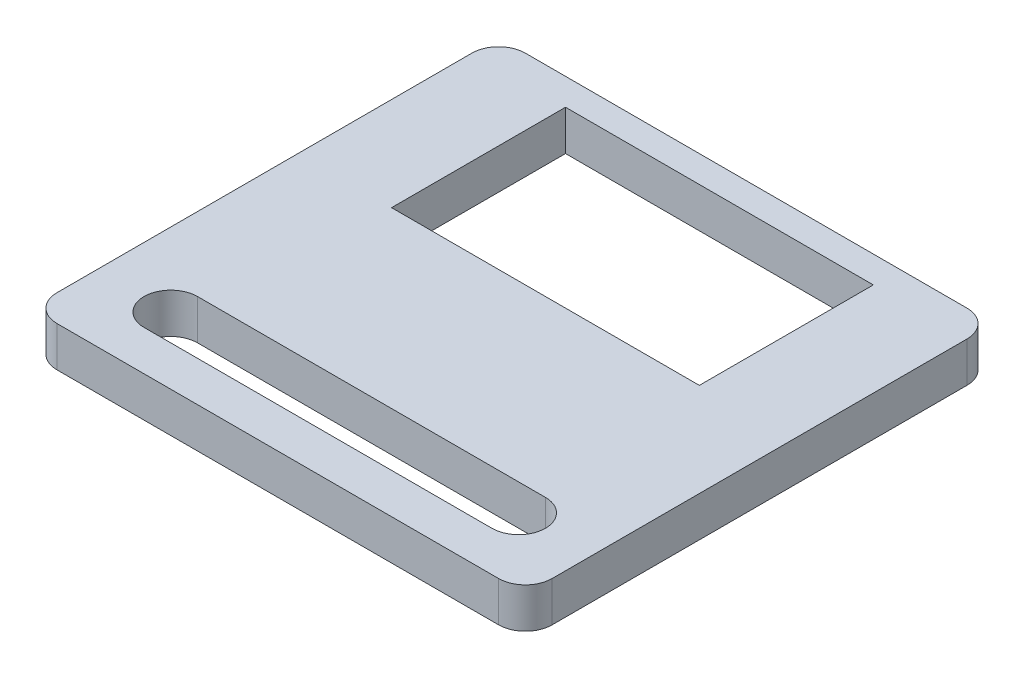
ISO-10303-21;
HEADER;
FILE_DESCRIPTION(('STEP AP214'),'2;1');
FILE_NAME('part.step','',(''),(''),'','','');
FILE_SCHEMA(('AUTOMOTIVE_DESIGN { 1 0 10303 214 1 1 1 1 }'));
ENDSEC;
DATA;
#1=APPLICATION_CONTEXT('core data for automotive mechanical design processes');
#2=APPLICATION_PROTOCOL_DEFINITION('international standard','automotive_design',2000,#1);
#3=PRODUCT_CONTEXT('',#1,'mechanical');
#4=PRODUCT('Part','Part','',(#3));
#5=PRODUCT_RELATED_PRODUCT_CATEGORY('part','',(#4));
#6=PRODUCT_DEFINITION_FORMATION('','',#4);
#7=PRODUCT_DEFINITION_CONTEXT('part definition',#1,'design');
#8=PRODUCT_DEFINITION('design','',#6,#7);
#9=PRODUCT_DEFINITION_SHAPE('','',#8);
#10=(LENGTH_UNIT() NAMED_UNIT(*) SI_UNIT(.MILLI.,.METRE.));
#11=(NAMED_UNIT(*) PLANE_ANGLE_UNIT() SI_UNIT($,.RADIAN.));
#12=(NAMED_UNIT(*) SI_UNIT($,.STERADIAN.) SOLID_ANGLE_UNIT());
#13=UNCERTAINTY_MEASURE_WITH_UNIT(LENGTH_MEASURE(1.E-05),#10,'distance_accuracy_value','');
#14=(GEOMETRIC_REPRESENTATION_CONTEXT(3) GLOBAL_UNCERTAINTY_ASSIGNED_CONTEXT((#13)) GLOBAL_UNIT_ASSIGNED_CONTEXT((#10,
#11,#12)) REPRESENTATION_CONTEXT('',''));
#15=CARTESIAN_POINT('',(0.,0.,0.));
#16=DIRECTION('',(0.,0.,1.));
#17=DIRECTION('',(1.,0.,0.));
#18=AXIS2_PLACEMENT_3D('',#15,#16,#17);
#19=CARTESIAN_POINT('',(0.,3.,0.));
#20=DIRECTION('',(0.,-1.,0.));
#21=DIRECTION('',(0.,0.,-1.));
#22=AXIS2_PLACEMENT_3D('',#19,#20,#21);
#23=PLANE('',#22);
#24=DIRECTION('',(0.,0.,-1.));
#25=VECTOR('',#24,1.);
#26=CARTESIAN_POINT('',(11.5,3.,-15.5));
#27=LINE('',#26,#25);
#28=CARTESIAN_POINT('',(11.5,3.,-2.5));
#29=VERTEX_POINT('',#28);
#30=CARTESIAN_POINT('',(11.5,3.,-15.5));
#31=VERTEX_POINT('',#30);
#32=EDGE_CURVE('E212',#29,#31,#27,.T.);
#33=ORIENTED_EDGE('',*,*,#32,.F.);
#34=DIRECTION('',(1.,0.,0.));
#35=VECTOR('',#34,1.);
#36=CARTESIAN_POINT('',(-11.5,3.,-2.5));
#37=LINE('',#36,#35);
#38=CARTESIAN_POINT('',(-11.5,3.,-2.5));
#39=VERTEX_POINT('',#38);
#40=EDGE_CURVE('E223',#39,#29,#37,.T.);
#41=ORIENTED_EDGE('',*,*,#40,.F.);
#42=DIRECTION('',(0.,0.,1.));
#43=VECTOR('',#42,1.);
#44=CARTESIAN_POINT('',(-11.5,3.,-15.5));
#45=LINE('',#44,#43);
#46=CARTESIAN_POINT('',(-11.5,3.,-15.5));
#47=VERTEX_POINT('',#46);
#48=EDGE_CURVE('E219',#47,#39,#45,.T.);
#49=ORIENTED_EDGE('',*,*,#48,.F.);
#50=DIRECTION('',(-1.,0.,0.));
#51=VECTOR('',#50,1.);
#52=CARTESIAN_POINT('',(-11.5,3.,-15.5));
#53=LINE('',#52,#51);
#54=EDGE_CURVE('E215',#31,#47,#53,.T.);
#55=ORIENTED_EDGE('',*,*,#54,.F.);
#56=EDGE_LOOP('',(#33,#41,#49,#55));
#57=FACE_BOUND('',#56,.T.);
#58=DIRECTION('',(0.,0.,-1.));
#59=VECTOR('',#58,1.);
#60=CARTESIAN_POINT('',(18.5,3.,17.5));
#61=LINE('',#60,#59);
#62=CARTESIAN_POINT('',(18.5,3.,15.5));
#63=VERTEX_POINT('',#62);
#64=CARTESIAN_POINT('',(18.5,3.,-15.5));
#65=VERTEX_POINT('',#64);
#66=EDGE_CURVE('E255',#63,#65,#61,.T.);
#67=ORIENTED_EDGE('',*,*,#66,.T.);
#68=CARTESIAN_POINT('',(16.5,3.,-15.5));
#69=DIRECTION('',(0.,-1.,0.));
#70=DIRECTION('',(0.,0.,-1.));
#71=AXIS2_PLACEMENT_3D('',#68,#69,#70);
#72=CIRCLE('',#71,2.);
#73=CARTESIAN_POINT('',(16.5,3.,-17.5));
#74=VERTEX_POINT('',#73);
#75=EDGE_CURVE('E317',#65,#74,#72,.F.);
#76=ORIENTED_EDGE('',*,*,#75,.T.);
#77=DIRECTION('',(-1.,0.,0.));
#78=VECTOR('',#77,1.);
#79=CARTESIAN_POINT('',(-18.5,3.,-17.5));
#80=LINE('',#79,#78);
#81=CARTESIAN_POINT('',(-16.5,3.,-17.5));
#82=VERTEX_POINT('',#81);
#83=EDGE_CURVE('E259',#74,#82,#80,.T.);
#84=ORIENTED_EDGE('',*,*,#83,.T.);
#85=CARTESIAN_POINT('',(-16.5,3.,-15.5));
#86=DIRECTION('',(0.,-1.,0.));
#87=DIRECTION('',(0.,0.,-1.));
#88=AXIS2_PLACEMENT_3D('',#85,#86,#87);
#89=CIRCLE('',#88,2.);
#90=CARTESIAN_POINT('',(-18.5,3.,-15.5));
#91=VERTEX_POINT('',#90);
#92=EDGE_CURVE('E309',#82,#91,#89,.F.);
#93=ORIENTED_EDGE('',*,*,#92,.T.);
#94=DIRECTION('',(0.,0.,1.));
#95=VECTOR('',#94,1.);
#96=CARTESIAN_POINT('',(-18.5,3.,17.5));
#97=LINE('',#96,#95);
#98=CARTESIAN_POINT('',(-18.5,3.,15.5));
#99=VERTEX_POINT('',#98);
#100=EDGE_CURVE('E264',#91,#99,#97,.T.);
#101=ORIENTED_EDGE('',*,*,#100,.T.);
#102=CARTESIAN_POINT('',(-16.5,3.,15.5));
#103=DIRECTION('',(0.,-1.,0.));
#104=DIRECTION('',(0.,0.,-1.));
#105=AXIS2_PLACEMENT_3D('',#102,#103,#104);
#106=CIRCLE('',#105,2.);
#107=CARTESIAN_POINT('',(-16.5,3.,17.5));
#108=VERTEX_POINT('',#107);
#109=EDGE_CURVE('E66',#99,#108,#106,.F.);
#110=ORIENTED_EDGE('',*,*,#109,.T.);
#111=DIRECTION('',(1.,0.,0.));
#112=VECTOR('',#111,1.);
#113=CARTESIAN_POINT('',(-18.5,3.,17.5));
#114=LINE('',#113,#112);
#115=CARTESIAN_POINT('',(16.5,3.,17.5));
#116=VERTEX_POINT('',#115);
#117=EDGE_CURVE('E267',#108,#116,#114,.T.);
#118=ORIENTED_EDGE('',*,*,#117,.T.);
#119=CARTESIAN_POINT('',(16.5,3.,15.5));
#120=DIRECTION('',(0.,-1.,0.));
#121=DIRECTION('',(0.,0.,-1.));
#122=AXIS2_PLACEMENT_3D('',#119,#120,#121);
#123=CIRCLE('',#122,2.);
#124=EDGE_CURVE('E314',#116,#63,#123,.F.);
#125=ORIENTED_EDGE('',*,*,#124,.T.);
#126=EDGE_LOOP('',(#67,#76,#84,#93,#101,#110,#118,#125));
#127=FACE_BOUND('',#126,.T.);
#128=CARTESIAN_POINT('',(-13.,3.,12.5));
#129=DIRECTION('',(0.,1.,0.));
#130=DIRECTION('',(0.,0.,1.));
#131=AXIS2_PLACEMENT_3D('',#128,#129,#130);
#132=CIRCLE('',#131,2.);
#133=CARTESIAN_POINT('',(-13.,3.,10.5));
#134=VERTEX_POINT('',#133);
#135=CARTESIAN_POINT('',(-13.,3.,14.5));
#136=VERTEX_POINT('',#135);
#137=EDGE_CURVE('E159',#134,#136,#132,.T.);
#138=ORIENTED_EDGE('',*,*,#137,.F.);
#139=DIRECTION('',(-1.,0.,0.));
#140=VECTOR('',#139,1.);
#141=CARTESIAN_POINT('',(-13.,3.,10.5));
#142=LINE('',#141,#140);
#143=CARTESIAN_POINT('',(13.,3.,10.5));
#144=VERTEX_POINT('',#143);
#145=EDGE_CURVE('E188',#144,#134,#142,.T.);
#146=ORIENTED_EDGE('',*,*,#145,.F.);
#147=CARTESIAN_POINT('',(13.,3.,12.5));
#148=DIRECTION('',(0.,1.,0.));
#149=DIRECTION('',(0.,0.,-1.));
#150=AXIS2_PLACEMENT_3D('',#147,#148,#149);
#151=CIRCLE('',#150,2.);
#152=CARTESIAN_POINT('',(13.,3.,14.5));
#153=VERTEX_POINT('',#152);
#154=EDGE_CURVE('E184',#153,#144,#151,.T.);
#155=ORIENTED_EDGE('',*,*,#154,.F.);
#156=DIRECTION('',(1.,0.,0.));
#157=VECTOR('',#156,1.);
#158=CARTESIAN_POINT('',(-13.,3.,14.5));
#159=LINE('',#158,#157);
#160=EDGE_CURVE('E170',#136,#153,#159,.T.);
#161=ORIENTED_EDGE('',*,*,#160,.F.);
#162=EDGE_LOOP('',(#138,#146,#155,#161));
#163=FACE_BOUND('',#162,.T.);
#164=ADVANCED_FACE('F43',(#57,#127,#163),#23,.F.);
#165=CARTESIAN_POINT('',(0.,0.,0.));
#166=DIRECTION('',(0.,-1.,0.));
#167=DIRECTION('',(0.,0.,-1.));
#168=AXIS2_PLACEMENT_3D('',#165,#166,#167);
#169=PLANE('',#168);
#170=DIRECTION('',(-1.,0.,0.));
#171=VECTOR('',#170,1.);
#172=CARTESIAN_POINT('',(-18.5,0.,-17.5));
#173=LINE('',#172,#171);
#174=CARTESIAN_POINT('',(16.5,0.,-17.5));
#175=VERTEX_POINT('',#174);
#176=CARTESIAN_POINT('',(-16.5,0.,-17.5));
#177=VERTEX_POINT('',#176);
#178=EDGE_CURVE('E274',#175,#177,#173,.T.);
#179=ORIENTED_EDGE('',*,*,#178,.F.);
#180=CARTESIAN_POINT('',(16.5,0.,-15.5));
#181=DIRECTION('',(0.,-1.,0.));
#182=DIRECTION('',(0.,0.,-1.));
#183=AXIS2_PLACEMENT_3D('',#180,#181,#182);
#184=CIRCLE('',#183,2.);
#185=CARTESIAN_POINT('',(18.5,0.,-15.5));
#186=VERTEX_POINT('',#185);
#187=EDGE_CURVE('E299',#175,#186,#184,.T.);
#188=ORIENTED_EDGE('',*,*,#187,.T.);
#189=DIRECTION('',(0.,0.,-1.));
#190=VECTOR('',#189,1.);
#191=CARTESIAN_POINT('',(18.5,0.,17.5));
#192=LINE('',#191,#190);
#193=CARTESIAN_POINT('',(18.5,0.,15.5));
#194=VERTEX_POINT('',#193);
#195=EDGE_CURVE('E254',#194,#186,#192,.T.);
#196=ORIENTED_EDGE('',*,*,#195,.F.);
#197=CARTESIAN_POINT('',(16.5,0.,15.5));
#198=DIRECTION('',(0.,-1.,0.));
#199=DIRECTION('',(0.,0.,-1.));
#200=AXIS2_PLACEMENT_3D('',#197,#198,#199);
#201=CIRCLE('',#200,2.);
#202=CARTESIAN_POINT('',(16.5,0.,17.5));
#203=VERTEX_POINT('',#202);
#204=EDGE_CURVE('E296',#194,#203,#201,.T.);
#205=ORIENTED_EDGE('',*,*,#204,.T.);
#206=DIRECTION('',(1.,0.,0.));
#207=VECTOR('',#206,1.);
#208=CARTESIAN_POINT('',(-18.5,0.,17.5));
#209=LINE('',#208,#207);
#210=CARTESIAN_POINT('',(-16.5,0.,17.5));
#211=VERTEX_POINT('',#210);
#212=EDGE_CURVE('E260',#211,#203,#209,.T.);
#213=ORIENTED_EDGE('',*,*,#212,.F.);
#214=CARTESIAN_POINT('',(-16.5,0.,15.5));
#215=DIRECTION('',(0.,-1.,0.));
#216=DIRECTION('',(0.,0.,-1.));
#217=AXIS2_PLACEMENT_3D('',#214,#215,#216);
#218=CIRCLE('',#217,2.);
#219=CARTESIAN_POINT('',(-18.5,0.,15.5));
#220=VERTEX_POINT('',#219);
#221=EDGE_CURVE('E293',#211,#220,#218,.T.);
#222=ORIENTED_EDGE('',*,*,#221,.T.);
#223=DIRECTION('',(0.,0.,1.));
#224=VECTOR('',#223,1.);
#225=CARTESIAN_POINT('',(-18.5,0.,17.5));
#226=LINE('',#225,#224);
#227=CARTESIAN_POINT('',(-18.5,0.,-15.5));
#228=VERTEX_POINT('',#227);
#229=EDGE_CURVE('E278',#228,#220,#226,.T.);
#230=ORIENTED_EDGE('',*,*,#229,.F.);
#231=CARTESIAN_POINT('',(-16.5,0.,-15.5));
#232=DIRECTION('',(0.,-1.,0.));
#233=DIRECTION('',(0.,0.,-1.));
#234=AXIS2_PLACEMENT_3D('',#231,#232,#233);
#235=CIRCLE('',#234,2.);
#236=EDGE_CURVE('E290',#228,#177,#235,.T.);
#237=ORIENTED_EDGE('',*,*,#236,.T.);
#238=EDGE_LOOP('',(#179,#188,#196,#205,#213,#222,#230,#237));
#239=FACE_BOUND('',#238,.T.);
#240=DIRECTION('',(1.,0.,0.));
#241=VECTOR('',#240,1.);
#242=CARTESIAN_POINT('',(-11.5,0.,-2.5));
#243=LINE('',#242,#241);
#244=CARTESIAN_POINT('',(-11.5,0.,-2.5));
#245=VERTEX_POINT('',#244);
#246=CARTESIAN_POINT('',(11.5,0.,-2.5));
#247=VERTEX_POINT('',#246);
#248=EDGE_CURVE('E216',#245,#247,#243,.T.);
#249=ORIENTED_EDGE('',*,*,#248,.T.);
#250=DIRECTION('',(0.,0.,-1.));
#251=VECTOR('',#250,1.);
#252=CARTESIAN_POINT('',(11.5,0.,-15.5));
#253=LINE('',#252,#251);
#254=CARTESIAN_POINT('',(11.5,0.,-15.5));
#255=VERTEX_POINT('',#254);
#256=EDGE_CURVE('E179',#247,#255,#253,.T.);
#257=ORIENTED_EDGE('',*,*,#256,.T.);
#258=DIRECTION('',(-1.,0.,0.));
#259=VECTOR('',#258,1.);
#260=CARTESIAN_POINT('',(-11.5,0.,-15.5));
#261=LINE('',#260,#259);
#262=CARTESIAN_POINT('',(-11.5,0.,-15.5));
#263=VERTEX_POINT('',#262);
#264=EDGE_CURVE('E230',#255,#263,#261,.T.);
#265=ORIENTED_EDGE('',*,*,#264,.T.);
#266=DIRECTION('',(0.,0.,1.));
#267=VECTOR('',#266,1.);
#268=CARTESIAN_POINT('',(-11.5,0.,-15.5));
#269=LINE('',#268,#267);
#270=EDGE_CURVE('E234',#263,#245,#269,.T.);
#271=ORIENTED_EDGE('',*,*,#270,.T.);
#272=EDGE_LOOP('',(#249,#257,#265,#271));
#273=FACE_BOUND('',#272,.T.);
#274=DIRECTION('',(-1.,0.,0.));
#275=VECTOR('',#274,1.);
#276=CARTESIAN_POINT('',(-13.,0.,10.5));
#277=LINE('',#276,#275);
#278=CARTESIAN_POINT('',(13.,0.,10.5));
#279=VERTEX_POINT('',#278);
#280=CARTESIAN_POINT('',(-13.,0.,10.5));
#281=VERTEX_POINT('',#280);
#282=EDGE_CURVE('E171',#279,#281,#277,.T.);
#283=ORIENTED_EDGE('',*,*,#282,.T.);
#284=CARTESIAN_POINT('',(-13.,0.,12.5));
#285=DIRECTION('',(0.,1.,0.));
#286=DIRECTION('',(0.,0.,1.));
#287=AXIS2_PLACEMENT_3D('',#284,#285,#286);
#288=CIRCLE('',#287,2.);
#289=CARTESIAN_POINT('',(-13.,0.,14.5));
#290=VERTEX_POINT('',#289);
#291=EDGE_CURVE('E193',#281,#290,#288,.T.);
#292=ORIENTED_EDGE('',*,*,#291,.T.);
#293=DIRECTION('',(1.,0.,0.));
#294=VECTOR('',#293,1.);
#295=CARTESIAN_POINT('',(-13.,0.,14.5));
#296=LINE('',#295,#294);
#297=CARTESIAN_POINT('',(13.,0.,14.5));
#298=VERTEX_POINT('',#297);
#299=EDGE_CURVE('E177',#290,#298,#296,.T.);
#300=ORIENTED_EDGE('',*,*,#299,.T.);
#301=CARTESIAN_POINT('',(13.,0.,12.5));
#302=DIRECTION('',(0.,1.,0.));
#303=DIRECTION('',(0.,0.,-1.));
#304=AXIS2_PLACEMENT_3D('',#301,#302,#303);
#305=CIRCLE('',#304,2.);
#306=EDGE_CURVE('E198',#298,#279,#305,.T.);
#307=ORIENTED_EDGE('',*,*,#306,.T.);
#308=EDGE_LOOP('',(#283,#292,#300,#307));
#309=FACE_BOUND('',#308,.T.);
#310=ADVANCED_FACE('F337',(#239,#273,#309),#169,.T.);
#311=CARTESIAN_POINT('',(18.5,3.,17.5));
#312=DIRECTION('',(-1.,0.,0.));
#313=DIRECTION('',(0.,0.,1.));
#314=AXIS2_PLACEMENT_3D('',#311,#312,#313);
#315=PLANE('',#314);
#316=ORIENTED_EDGE('',*,*,#195,.T.);
#317=DIRECTION('',(0.,-1.,0.));
#318=VECTOR('',#317,1.);
#319=CARTESIAN_POINT('',(18.5,3.,-15.5));
#320=LINE('',#319,#318);
#321=EDGE_CURVE('E306',#186,#65,#320,.F.);
#322=ORIENTED_EDGE('',*,*,#321,.T.);
#323=ORIENTED_EDGE('',*,*,#66,.F.);
#324=DIRECTION('',(0.,-1.,0.));
#325=VECTOR('',#324,1.);
#326=CARTESIAN_POINT('',(18.5,3.,15.5));
#327=LINE('',#326,#325);
#328=EDGE_CURVE('E302',#63,#194,#327,.T.);
#329=ORIENTED_EDGE('',*,*,#328,.T.);
#330=EDGE_LOOP('',(#316,#322,#323,#329));
#331=FACE_BOUND('',#330,.T.);
#332=ADVANCED_FACE('F351',(#331),#315,.F.);
#333=CARTESIAN_POINT('',(-18.5,3.,-17.5));
#334=DIRECTION('',(0.,0.,1.));
#335=DIRECTION('',(1.,0.,0.));
#336=AXIS2_PLACEMENT_3D('',#333,#334,#335);
#337=PLANE('',#336);
#338=ORIENTED_EDGE('',*,*,#83,.F.);
#339=DIRECTION('',(0.,-1.,0.));
#340=VECTOR('',#339,1.);
#341=CARTESIAN_POINT('',(16.5,3.,-17.5));
#342=LINE('',#341,#340);
#343=EDGE_CURVE('E286',#74,#175,#342,.T.);
#344=ORIENTED_EDGE('',*,*,#343,.T.);
#345=ORIENTED_EDGE('',*,*,#178,.T.);
#346=DIRECTION('',(0.,-1.,0.));
#347=VECTOR('',#346,1.);
#348=CARTESIAN_POINT('',(-16.5,3.,-17.5));
#349=LINE('',#348,#347);
#350=EDGE_CURVE('E270',#177,#82,#349,.F.);
#351=ORIENTED_EDGE('',*,*,#350,.T.);
#352=EDGE_LOOP('',(#338,#344,#345,#351));
#353=FACE_BOUND('',#352,.T.);
#354=ADVANCED_FACE('F359',(#353),#337,.F.);
#355=CARTESIAN_POINT('',(-18.5,3.,17.5));
#356=DIRECTION('',(1.,0.,0.));
#357=DIRECTION('',(0.,0.,-1.));
#358=AXIS2_PLACEMENT_3D('',#355,#356,#357);
#359=PLANE('',#358);
#360=ORIENTED_EDGE('',*,*,#229,.T.);
#361=DIRECTION('',(0.,-1.,0.));
#362=VECTOR('',#361,1.);
#363=CARTESIAN_POINT('',(-18.5,3.,15.5));
#364=LINE('',#363,#362);
#365=EDGE_CURVE('E11',#220,#99,#364,.F.);
#366=ORIENTED_EDGE('',*,*,#365,.T.);
#367=ORIENTED_EDGE('',*,*,#100,.F.);
#368=DIRECTION('',(0.,-1.,0.));
#369=VECTOR('',#368,1.);
#370=CARTESIAN_POINT('',(-18.5,3.,-15.5));
#371=LINE('',#370,#369);
#372=EDGE_CURVE('E52',#91,#228,#371,.T.);
#373=ORIENTED_EDGE('',*,*,#372,.T.);
#374=EDGE_LOOP('',(#360,#366,#367,#373));
#375=FACE_BOUND('',#374,.T.);
#376=ADVANCED_FACE('F331',(#375),#359,.F.);
#377=CARTESIAN_POINT('',(-18.5,3.,17.5));
#378=DIRECTION('',(0.,0.,-1.));
#379=DIRECTION('',(-1.,0.,0.));
#380=AXIS2_PLACEMENT_3D('',#377,#378,#379);
#381=PLANE('',#380);
#382=ORIENTED_EDGE('',*,*,#212,.T.);
#383=DIRECTION('',(0.,-1.,0.));
#384=VECTOR('',#383,1.);
#385=CARTESIAN_POINT('',(16.5,3.,17.5));
#386=LINE('',#385,#384);
#387=EDGE_CURVE('E59',#203,#116,#386,.F.);
#388=ORIENTED_EDGE('',*,*,#387,.T.);
#389=ORIENTED_EDGE('',*,*,#117,.F.);
#390=DIRECTION('',(0.,-1.,0.));
#391=VECTOR('',#390,1.);
#392=CARTESIAN_POINT('',(-16.5,3.,17.5));
#393=LINE('',#392,#391);
#394=EDGE_CURVE('E320',#108,#211,#393,.T.);
#395=ORIENTED_EDGE('',*,*,#394,.T.);
#396=EDGE_LOOP('',(#382,#388,#389,#395));
#397=FACE_BOUND('',#396,.T.);
#398=ADVANCED_FACE('F343',(#397),#381,.F.);
#399=CARTESIAN_POINT('',(11.5,3.,-15.5));
#400=DIRECTION('',(-1.,0.,0.));
#401=DIRECTION('',(0.,0.,1.));
#402=AXIS2_PLACEMENT_3D('',#399,#400,#401);
#403=PLANE('',#402);
#404=ORIENTED_EDGE('',*,*,#256,.F.);
#405=DIRECTION('',(0.,-1.,0.));
#406=VECTOR('',#405,1.);
#407=CARTESIAN_POINT('',(11.5,3.,-2.5));
#408=LINE('',#407,#406);
#409=EDGE_CURVE('E226',#29,#247,#408,.T.);
#410=ORIENTED_EDGE('',*,*,#409,.F.);
#411=ORIENTED_EDGE('',*,*,#32,.T.);
#412=DIRECTION('',(0.,-1.,0.));
#413=VECTOR('',#412,1.);
#414=CARTESIAN_POINT('',(11.5,3.,-15.5));
#415=LINE('',#414,#413);
#416=EDGE_CURVE('E250',#31,#255,#415,.T.);
#417=ORIENTED_EDGE('',*,*,#416,.T.);
#418=EDGE_LOOP('',(#404,#410,#411,#417));
#419=FACE_BOUND('',#418,.T.);
#420=ADVANCED_FACE('F374',(#419),#403,.T.);
#421=CARTESIAN_POINT('',(-11.5,3.,-15.5));
#422=DIRECTION('',(0.,0.,1.));
#423=DIRECTION('',(1.,0.,0.));
#424=AXIS2_PLACEMENT_3D('',#421,#422,#423);
#425=PLANE('',#424);
#426=ORIENTED_EDGE('',*,*,#264,.F.);
#427=ORIENTED_EDGE('',*,*,#416,.F.);
#428=ORIENTED_EDGE('',*,*,#54,.T.);
#429=DIRECTION('',(0.,-1.,0.));
#430=VECTOR('',#429,1.);
#431=CARTESIAN_POINT('',(-11.5,3.,-15.5));
#432=LINE('',#431,#430);
#433=EDGE_CURVE('E247',#47,#263,#432,.T.);
#434=ORIENTED_EDGE('',*,*,#433,.T.);
#435=EDGE_LOOP('',(#426,#427,#428,#434));
#436=FACE_BOUND('',#435,.T.);
#437=ADVANCED_FACE('F469',(#436),#425,.T.);
#438=CARTESIAN_POINT('',(-11.5,3.,-15.5));
#439=DIRECTION('',(1.,0.,0.));
#440=DIRECTION('',(0.,0.,-1.));
#441=AXIS2_PLACEMENT_3D('',#438,#439,#440);
#442=PLANE('',#441);
#443=ORIENTED_EDGE('',*,*,#270,.F.);
#444=ORIENTED_EDGE('',*,*,#433,.F.);
#445=ORIENTED_EDGE('',*,*,#48,.T.);
#446=DIRECTION('',(0.,-1.,0.));
#447=VECTOR('',#446,1.);
#448=CARTESIAN_POINT('',(-11.5,3.,-2.5));
#449=LINE('',#448,#447);
#450=EDGE_CURVE('E244',#39,#245,#449,.T.);
#451=ORIENTED_EDGE('',*,*,#450,.T.);
#452=EDGE_LOOP('',(#443,#444,#445,#451));
#453=FACE_BOUND('',#452,.T.);
#454=ADVANCED_FACE('F459',(#453),#442,.T.);
#455=CARTESIAN_POINT('',(-11.5,3.,-2.5));
#456=DIRECTION('',(0.,0.,-1.));
#457=DIRECTION('',(-1.,0.,0.));
#458=AXIS2_PLACEMENT_3D('',#455,#456,#457);
#459=PLANE('',#458);
#460=ORIENTED_EDGE('',*,*,#248,.F.);
#461=ORIENTED_EDGE('',*,*,#450,.F.);
#462=ORIENTED_EDGE('',*,*,#40,.T.);
#463=ORIENTED_EDGE('',*,*,#409,.T.);
#464=EDGE_LOOP('',(#460,#461,#462,#463));
#465=FACE_BOUND('',#464,.T.);
#466=ADVANCED_FACE('F450',(#465),#459,.T.);
#467=CARTESIAN_POINT('',(-13.,3.,12.5));
#468=DIRECTION('',(0.,-1.,0.));
#469=DIRECTION('',(0.,0.,-1.));
#470=AXIS2_PLACEMENT_3D('',#467,#468,#469);
#471=CYLINDRICAL_SURFACE('',#470,2.);
#472=ORIENTED_EDGE('',*,*,#291,.F.);
#473=DIRECTION('',(0.,-1.,0.));
#474=VECTOR('',#473,1.);
#475=CARTESIAN_POINT('',(-13.,3.,10.5));
#476=LINE('',#475,#474);
#477=EDGE_CURVE('E165',#134,#281,#476,.T.);
#478=ORIENTED_EDGE('',*,*,#477,.F.);
#479=ORIENTED_EDGE('',*,*,#137,.T.);
#480=DIRECTION('',(0.,-1.,0.));
#481=VECTOR('',#480,1.);
#482=CARTESIAN_POINT('',(-13.,3.,14.5));
#483=LINE('',#482,#481);
#484=EDGE_CURVE('E162',#136,#290,#483,.T.);
#485=ORIENTED_EDGE('',*,*,#484,.T.);
#486=EDGE_LOOP('',(#472,#478,#479,#485));
#487=FACE_BOUND('',#486,.T.);
#488=ADVANCED_FACE('F161',(#487),#471,.F.);
#489=CARTESIAN_POINT('',(-13.,3.,14.5));
#490=DIRECTION('',(0.,0.,-1.));
#491=DIRECTION('',(-1.,0.,0.));
#492=AXIS2_PLACEMENT_3D('',#489,#490,#491);
#493=PLANE('',#492);
#494=ORIENTED_EDGE('',*,*,#299,.F.);
#495=ORIENTED_EDGE('',*,*,#484,.F.);
#496=ORIENTED_EDGE('',*,*,#160,.T.);
#497=DIRECTION('',(0.,-1.,0.));
#498=VECTOR('',#497,1.);
#499=CARTESIAN_POINT('',(13.,3.,14.5));
#500=LINE('',#499,#498);
#501=EDGE_CURVE('E180',#153,#298,#500,.T.);
#502=ORIENTED_EDGE('',*,*,#501,.T.);
#503=EDGE_LOOP('',(#494,#495,#496,#502));
#504=FACE_BOUND('',#503,.T.);
#505=ADVANCED_FACE('F174',(#504),#493,.T.);
#506=CARTESIAN_POINT('',(13.,3.,12.5));
#507=DIRECTION('',(0.,-1.,0.));
#508=DIRECTION('',(0.,0.,-1.));
#509=AXIS2_PLACEMENT_3D('',#506,#507,#508);
#510=CYLINDRICAL_SURFACE('',#509,2.);
#511=ORIENTED_EDGE('',*,*,#306,.F.);
#512=ORIENTED_EDGE('',*,*,#501,.F.);
#513=ORIENTED_EDGE('',*,*,#154,.T.);
#514=DIRECTION('',(0.,-1.,0.));
#515=VECTOR('',#514,1.);
#516=CARTESIAN_POINT('',(13.,3.,10.5));
#517=LINE('',#516,#515);
#518=EDGE_CURVE('E207',#144,#279,#517,.T.);
#519=ORIENTED_EDGE('',*,*,#518,.T.);
#520=EDGE_LOOP('',(#511,#512,#513,#519));
#521=FACE_BOUND('',#520,.T.);
#522=ADVANCED_FACE('F423',(#521),#510,.F.);
#523=CARTESIAN_POINT('',(-13.,3.,10.5));
#524=DIRECTION('',(0.,0.,1.));
#525=DIRECTION('',(1.,0.,0.));
#526=AXIS2_PLACEMENT_3D('',#523,#524,#525);
#527=PLANE('',#526);
#528=ORIENTED_EDGE('',*,*,#282,.F.);
#529=ORIENTED_EDGE('',*,*,#518,.F.);
#530=ORIENTED_EDGE('',*,*,#145,.T.);
#531=ORIENTED_EDGE('',*,*,#477,.T.);
#532=EDGE_LOOP('',(#528,#529,#530,#531));
#533=FACE_BOUND('',#532,.T.);
#534=ADVANCED_FACE('F387',(#533),#527,.T.);
#535=CARTESIAN_POINT('',(16.5,3.,-15.5));
#536=DIRECTION('',(0.,-1.,0.));
#537=DIRECTION('',(0.,0.,-1.));
#538=AXIS2_PLACEMENT_3D('',#535,#536,#537);
#539=CYLINDRICAL_SURFACE('',#538,2.);
#540=ORIENTED_EDGE('',*,*,#75,.F.);
#541=ORIENTED_EDGE('',*,*,#321,.F.);
#542=ORIENTED_EDGE('',*,*,#187,.F.);
#543=ORIENTED_EDGE('',*,*,#343,.F.);
#544=EDGE_LOOP('',(#540,#541,#542,#543));
#545=FACE_BOUND('',#544,.T.);
#546=ADVANCED_FACE('F356',(#545),#539,.T.);
#547=CARTESIAN_POINT('',(16.5,3.,15.5));
#548=DIRECTION('',(0.,-1.,0.));
#549=DIRECTION('',(0.,0.,-1.));
#550=AXIS2_PLACEMENT_3D('',#547,#548,#549);
#551=CYLINDRICAL_SURFACE('',#550,2.);
#552=ORIENTED_EDGE('',*,*,#124,.F.);
#553=ORIENTED_EDGE('',*,*,#387,.F.);
#554=ORIENTED_EDGE('',*,*,#204,.F.);
#555=ORIENTED_EDGE('',*,*,#328,.F.);
#556=EDGE_LOOP('',(#552,#553,#554,#555));
#557=FACE_BOUND('',#556,.T.);
#558=ADVANCED_FACE('F348',(#557),#551,.T.);
#559=CARTESIAN_POINT('',(-16.5,3.,15.5));
#560=DIRECTION('',(0.,-1.,0.));
#561=DIRECTION('',(0.,0.,-1.));
#562=AXIS2_PLACEMENT_3D('',#559,#560,#561);
#563=CYLINDRICAL_SURFACE('',#562,2.);
#564=ORIENTED_EDGE('',*,*,#109,.F.);
#565=ORIENTED_EDGE('',*,*,#365,.F.);
#566=ORIENTED_EDGE('',*,*,#221,.F.);
#567=ORIENTED_EDGE('',*,*,#394,.F.);
#568=EDGE_LOOP('',(#564,#565,#566,#567));
#569=FACE_BOUND('',#568,.T.);
#570=ADVANCED_FACE('F342',(#569),#563,.T.);
#571=CARTESIAN_POINT('',(-16.5,3.,-15.5));
#572=DIRECTION('',(0.,-1.,0.));
#573=DIRECTION('',(0.,0.,-1.));
#574=AXIS2_PLACEMENT_3D('',#571,#572,#573);
#575=CYLINDRICAL_SURFACE('',#574,2.);
#576=ORIENTED_EDGE('',*,*,#92,.F.);
#577=ORIENTED_EDGE('',*,*,#350,.F.);
#578=ORIENTED_EDGE('',*,*,#236,.F.);
#579=ORIENTED_EDGE('',*,*,#372,.F.);
#580=EDGE_LOOP('',(#576,#577,#578,#579));
#581=FACE_BOUND('',#580,.T.);
#582=ADVANCED_FACE('F45',(#581),#575,.T.);
#583=CLOSED_SHELL('',(#164,#310,#332,#354,#376,#398,#420,#437,#454,#466,#488,#505,#522,#534,
#546,#558,#570,#582));
#584=MANIFOLD_SOLID_BREP('B2',#583);
#585=ADVANCED_BREP_SHAPE_REPRESENTATION('',(#18,#584),#14);
#586=SHAPE_DEFINITION_REPRESENTATION(#9,#585);
ENDSEC;
END-ISO-10303-21;
